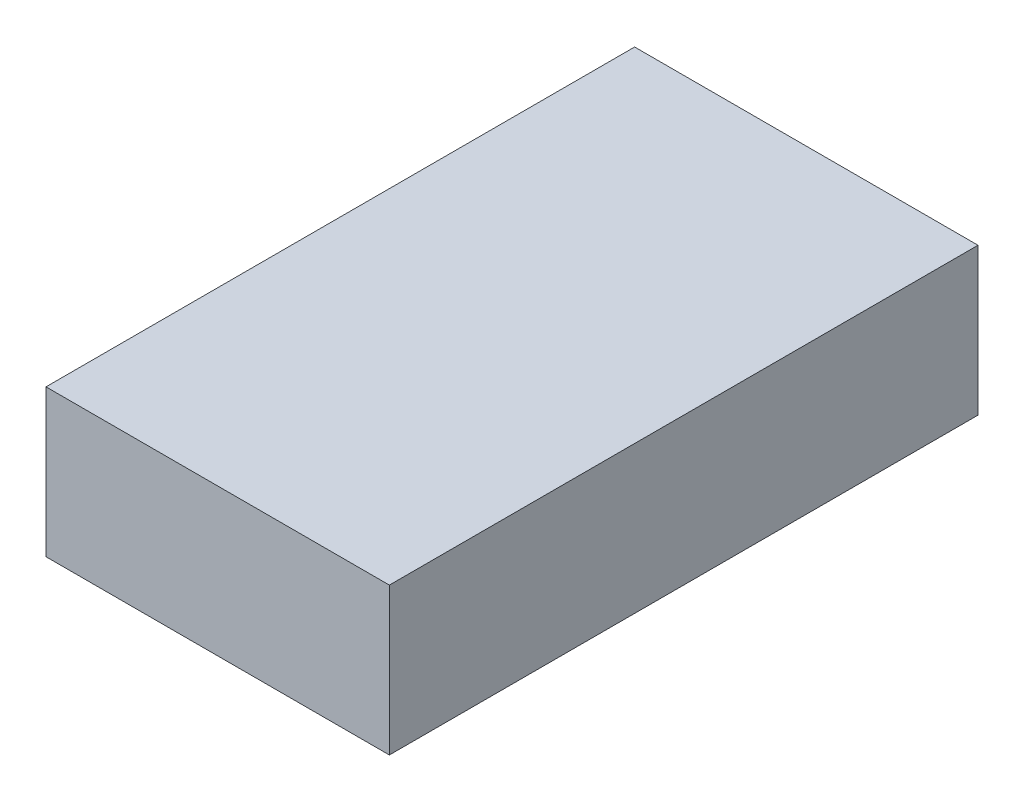
ISO-10303-21;
HEADER;
FILE_DESCRIPTION(('STEP AP214'),'2;1');
FILE_NAME('part.step','',(''),(''),'','','');
FILE_SCHEMA(('AUTOMOTIVE_DESIGN { 1 0 10303 214 1 1 1 1 }'));
ENDSEC;
DATA;
#1=APPLICATION_CONTEXT('core data for automotive mechanical design processes');
#2=APPLICATION_PROTOCOL_DEFINITION('international standard','automotive_design',2000,#1);
#3=PRODUCT_CONTEXT('',#1,'mechanical');
#4=PRODUCT('Part','Part','',(#3));
#5=PRODUCT_RELATED_PRODUCT_CATEGORY('part','',(#4));
#6=PRODUCT_DEFINITION_FORMATION('','',#4);
#7=PRODUCT_DEFINITION_CONTEXT('part definition',#1,'design');
#8=PRODUCT_DEFINITION('design','',#6,#7);
#9=PRODUCT_DEFINITION_SHAPE('','',#8);
#10=(LENGTH_UNIT() NAMED_UNIT(*) SI_UNIT(.MILLI.,.METRE.));
#11=(NAMED_UNIT(*) PLANE_ANGLE_UNIT() SI_UNIT($,.RADIAN.));
#12=(NAMED_UNIT(*) SI_UNIT($,.STERADIAN.) SOLID_ANGLE_UNIT());
#13=UNCERTAINTY_MEASURE_WITH_UNIT(LENGTH_MEASURE(1.E-05),#10,'distance_accuracy_value','');
#14=(GEOMETRIC_REPRESENTATION_CONTEXT(3) GLOBAL_UNCERTAINTY_ASSIGNED_CONTEXT((#13)) GLOBAL_UNIT_ASSIGNED_CONTEXT((#10,
#11,#12)) REPRESENTATION_CONTEXT('',''));
#15=CARTESIAN_POINT('',(0.,0.,0.));
#16=DIRECTION('',(0.,0.,1.));
#17=DIRECTION('',(1.,0.,0.));
#18=AXIS2_PLACEMENT_3D('',#15,#16,#17);
#19=CARTESIAN_POINT('',(0.,15.,0.));
#20=DIRECTION('',(0.,1.,0.));
#21=DIRECTION('',(0.,0.,1.));
#22=AXIS2_PLACEMENT_3D('',#19,#20,#21);
#23=PLANE('',#22);
#24=DIRECTION('',(-1.,0.,0.));
#25=VECTOR('',#24,1.);
#26=CARTESIAN_POINT('',(17.,15.,-29.9999999999998));
#27=LINE('',#26,#25);
#28=CARTESIAN_POINT('',(-18.,15.,-29.9999999999998));
#29=VERTEX_POINT('',#28);
#30=CARTESIAN_POINT('',(17.,15.,-29.9999999999998));
#31=VERTEX_POINT('',#30);
#32=EDGE_CURVE('E67',#29,#31,#27,.F.);
#33=ORIENTED_EDGE('',*,*,#32,.F.);
#34=DIRECTION('',(0.,0.,1.));
#35=VECTOR('',#34,1.);
#36=CARTESIAN_POINT('',(-18.,15.,-29.9999999999998));
#37=LINE('',#36,#35);
#38=CARTESIAN_POINT('',(-18.,15.,30.0000000000001));
#39=VERTEX_POINT('',#38);
#40=EDGE_CURVE('E19',#39,#29,#37,.F.);
#41=ORIENTED_EDGE('',*,*,#40,.F.);
#42=DIRECTION('',(1.,0.,0.));
#43=VECTOR('',#42,1.);
#44=CARTESIAN_POINT('',(-18.,15.,30.0000000000001));
#45=LINE('',#44,#43);
#46=CARTESIAN_POINT('',(17.,15.,30.0000000000001));
#47=VERTEX_POINT('',#46);
#48=EDGE_CURVE('E57',#47,#39,#45,.F.);
#49=ORIENTED_EDGE('',*,*,#48,.F.);
#50=DIRECTION('',(0.,0.,-1.));
#51=VECTOR('',#50,1.);
#52=CARTESIAN_POINT('',(17.,15.,30.0000000000001));
#53=LINE('',#52,#51);
#54=EDGE_CURVE('E52',#31,#47,#53,.F.);
#55=ORIENTED_EDGE('',*,*,#54,.F.);
#56=EDGE_LOOP('',(#33,#41,#49,#55));
#57=FACE_BOUND('',#56,.T.);
#58=ADVANCED_FACE('F16',(#57),#23,.T.);
#59=CARTESIAN_POINT('',(-18.,0.,-29.9999999999998));
#60=DIRECTION('',(-1.,0.,0.));
#61=DIRECTION('',(0.,0.,1.));
#62=AXIS2_PLACEMENT_3D('',#59,#60,#61);
#63=PLANE('',#62);
#64=DIRECTION('',(0.,1.,0.));
#65=VECTOR('',#64,1.);
#66=CARTESIAN_POINT('',(-18.,0.,-29.9999999999998));
#67=LINE('',#66,#65);
#68=CARTESIAN_POINT('',(-18.,0.,-29.9999999999998));
#69=VERTEX_POINT('',#68);
#70=EDGE_CURVE('E78',#69,#29,#67,.T.);
#71=ORIENTED_EDGE('',*,*,#70,.F.);
#72=DIRECTION('',(0.,0.,1.));
#73=VECTOR('',#72,1.);
#74=CARTESIAN_POINT('',(-18.,0.,0.));
#75=LINE('',#74,#73);
#76=CARTESIAN_POINT('',(-18.,0.,30.));
#77=VERTEX_POINT('',#76);
#78=EDGE_CURVE('E73',#69,#77,#75,.T.);
#79=ORIENTED_EDGE('',*,*,#78,.T.);
#80=DIRECTION('',(0.,1.,0.));
#81=VECTOR('',#80,1.);
#82=CARTESIAN_POINT('',(-18.,0.,30.));
#83=LINE('',#82,#81);
#84=EDGE_CURVE('E62',#39,#77,#83,.F.);
#85=ORIENTED_EDGE('',*,*,#84,.F.);
#86=ORIENTED_EDGE('',*,*,#40,.T.);
#87=EDGE_LOOP('',(#71,#79,#85,#86));
#88=FACE_BOUND('',#87,.T.);
#89=ADVANCED_FACE('F72',(#88),#63,.T.);
#90=CARTESIAN_POINT('',(-18.,0.,30.));
#91=DIRECTION('',(0.,0.,1.));
#92=DIRECTION('',(1.,0.,0.));
#93=AXIS2_PLACEMENT_3D('',#90,#91,#92);
#94=PLANE('',#93);
#95=ORIENTED_EDGE('',*,*,#84,.T.);
#96=DIRECTION('',(1.,0.,0.));
#97=VECTOR('',#96,1.);
#98=CARTESIAN_POINT('',(0.,0.,30.));
#99=LINE('',#98,#97);
#100=CARTESIAN_POINT('',(17.,0.,30.));
#101=VERTEX_POINT('',#100);
#102=EDGE_CURVE('E83',#77,#101,#99,.T.);
#103=ORIENTED_EDGE('',*,*,#102,.T.);
#104=DIRECTION('',(0.,1.,0.));
#105=VECTOR('',#104,1.);
#106=CARTESIAN_POINT('',(17.,0.,30.));
#107=LINE('',#106,#105);
#108=EDGE_CURVE('E64',#47,#101,#107,.F.);
#109=ORIENTED_EDGE('',*,*,#108,.F.);
#110=ORIENTED_EDGE('',*,*,#48,.T.);
#111=EDGE_LOOP('',(#95,#103,#109,#110));
#112=FACE_BOUND('',#111,.T.);
#113=ADVANCED_FACE('F59',(#112),#94,.T.);
#114=CARTESIAN_POINT('',(17.,0.,30.));
#115=DIRECTION('',(1.,0.,0.));
#116=DIRECTION('',(0.,0.,-1.));
#117=AXIS2_PLACEMENT_3D('',#114,#115,#116);
#118=PLANE('',#117);
#119=ORIENTED_EDGE('',*,*,#108,.T.);
#120=DIRECTION('',(0.,0.,1.));
#121=VECTOR('',#120,1.);
#122=CARTESIAN_POINT('',(17.,0.,0.));
#123=LINE('',#122,#121);
#124=CARTESIAN_POINT('',(17.,0.,-29.9999999999998));
#125=VERTEX_POINT('',#124);
#126=EDGE_CURVE('E25',#101,#125,#123,.F.);
#127=ORIENTED_EDGE('',*,*,#126,.T.);
#128=DIRECTION('',(0.,1.,0.));
#129=VECTOR('',#128,1.);
#130=CARTESIAN_POINT('',(17.,0.,-29.9999999999998));
#131=LINE('',#130,#129);
#132=EDGE_CURVE('E33',#31,#125,#131,.F.);
#133=ORIENTED_EDGE('',*,*,#132,.F.);
#134=ORIENTED_EDGE('',*,*,#54,.T.);
#135=EDGE_LOOP('',(#119,#127,#133,#134));
#136=FACE_BOUND('',#135,.T.);
#137=ADVANCED_FACE('F87',(#136),#118,.T.);
#138=CARTESIAN_POINT('',(17.,0.,-29.9999999999998));
#139=DIRECTION('',(0.,0.,-1.));
#140=DIRECTION('',(-1.,0.,0.));
#141=AXIS2_PLACEMENT_3D('',#138,#139,#140);
#142=PLANE('',#141);
#143=ORIENTED_EDGE('',*,*,#132,.T.);
#144=DIRECTION('',(1.,0.,0.));
#145=VECTOR('',#144,1.);
#146=CARTESIAN_POINT('',(0.,0.,-29.9999999999998));
#147=LINE('',#146,#145);
#148=EDGE_CURVE('E11',#125,#69,#147,.F.);
#149=ORIENTED_EDGE('',*,*,#148,.T.);
#150=ORIENTED_EDGE('',*,*,#70,.T.);
#151=ORIENTED_EDGE('',*,*,#32,.T.);
#152=EDGE_LOOP('',(#143,#149,#150,#151));
#153=FACE_BOUND('',#152,.T.);
#154=ADVANCED_FACE('F90',(#153),#142,.T.);
#155=CARTESIAN_POINT('',(0.,0.,0.));
#156=DIRECTION('',(0.,1.,0.));
#157=DIRECTION('',(0.,0.,1.));
#158=AXIS2_PLACEMENT_3D('',#155,#156,#157);
#159=PLANE('',#158);
#160=ORIENTED_EDGE('',*,*,#126,.F.);
#161=ORIENTED_EDGE('',*,*,#102,.F.);
#162=ORIENTED_EDGE('',*,*,#78,.F.);
#163=ORIENTED_EDGE('',*,*,#148,.F.);
#164=EDGE_LOOP('',(#160,#161,#162,#163));
#165=FACE_BOUND('',#164,.T.);
#166=ADVANCED_FACE('F89',(#165),#159,.F.);
#167=CLOSED_SHELL('',(#58,#89,#113,#137,#154,#166));
#168=MANIFOLD_SOLID_BREP('B1',#167);
#169=ADVANCED_BREP_SHAPE_REPRESENTATION('',(#18,#168),#14);
#170=SHAPE_DEFINITION_REPRESENTATION(#9,#169);
ENDSEC;
END-ISO-10303-21;
